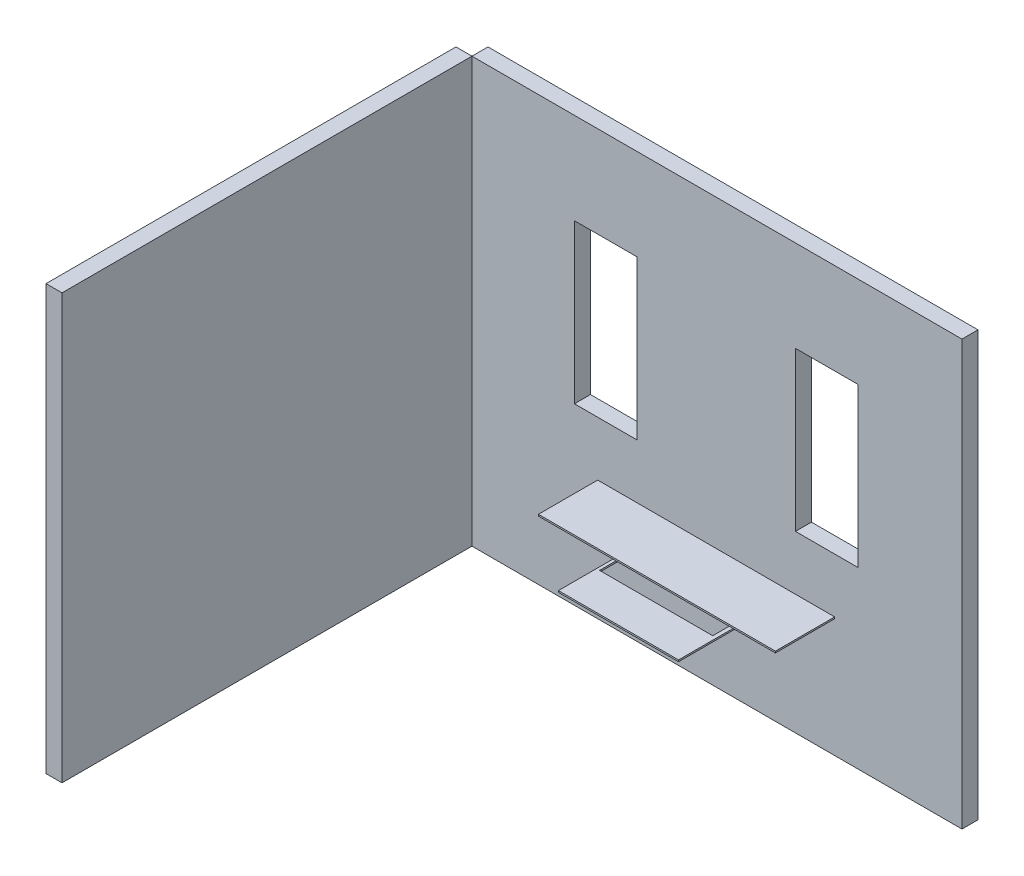
ISO-10303-21;
HEADER;
FILE_DESCRIPTION(('STEP AP214'),'2;1');
FILE_NAME('part.step','',(''),(''),'','','');
FILE_SCHEMA(('AUTOMOTIVE_DESIGN { 1 0 10303 214 1 1 1 1 }'));
ENDSEC;
DATA;
#1=APPLICATION_CONTEXT('core data for automotive mechanical design processes');
#2=APPLICATION_PROTOCOL_DEFINITION('international standard','automotive_design',2000,#1);
#3=PRODUCT_CONTEXT('',#1,'mechanical');
#4=PRODUCT('Part','Part','',(#3));
#5=PRODUCT_RELATED_PRODUCT_CATEGORY('part','',(#4));
#6=PRODUCT_DEFINITION_FORMATION('','',#4);
#7=PRODUCT_DEFINITION_CONTEXT('part definition',#1,'design');
#8=PRODUCT_DEFINITION('design','',#6,#7);
#9=PRODUCT_DEFINITION_SHAPE('','',#8);
#10=(LENGTH_UNIT() NAMED_UNIT(*) SI_UNIT(.MILLI.,.METRE.));
#11=(NAMED_UNIT(*) PLANE_ANGLE_UNIT() SI_UNIT($,.RADIAN.));
#12=(NAMED_UNIT(*) SI_UNIT($,.STERADIAN.) SOLID_ANGLE_UNIT());
#13=UNCERTAINTY_MEASURE_WITH_UNIT(LENGTH_MEASURE(1.E-05),#10,'distance_accuracy_value','');
#14=(GEOMETRIC_REPRESENTATION_CONTEXT(3) GLOBAL_UNCERTAINTY_ASSIGNED_CONTEXT((#13)) GLOBAL_UNIT_ASSIGNED_CONTEXT((#10,
#11,#12)) REPRESENTATION_CONTEXT('',''));
#15=CARTESIAN_POINT('',(0.,0.,0.));
#16=DIRECTION('',(0.,0.,1.));
#17=DIRECTION('',(1.,0.,0.));
#18=AXIS2_PLACEMENT_3D('',#15,#16,#17);
#19=CARTESIAN_POINT('',(0.,2650.,2660.));
#20=DIRECTION('',(-1.,0.,0.));
#21=DIRECTION('',(0.,0.,1.));
#22=AXIS2_PLACEMENT_3D('',#19,#20,#21);
#23=PLANE('',#22);
#24=DIRECTION('',(0.,1.,0.));
#25=VECTOR('',#24,1.);
#26=CARTESIAN_POINT('',(0.,2650.,100.));
#27=LINE('',#26,#25);
#28=CARTESIAN_POINT('',(0.,0.,100.));
#29=VERTEX_POINT('',#28);
#30=CARTESIAN_POINT('',(0.,2650.,100.));
#31=VERTEX_POINT('',#30);
#32=EDGE_CURVE('E106',#29,#31,#27,.T.);
#33=ORIENTED_EDGE('',*,*,#32,.T.);
#34=DIRECTION('',(0.,0.,-1.));
#35=VECTOR('',#34,1.);
#36=CARTESIAN_POINT('',(0.,2650.,2660.));
#37=LINE('',#36,#35);
#38=CARTESIAN_POINT('',(0.,2650.,2660.));
#39=VERTEX_POINT('',#38);
#40=EDGE_CURVE('E12',#39,#31,#37,.T.);
#41=ORIENTED_EDGE('',*,*,#40,.F.);
#42=DIRECTION('',(0.,1.,0.));
#43=VECTOR('',#42,1.);
#44=CARTESIAN_POINT('',(0.,2650.,2660.));
#45=LINE('',#44,#43);
#46=CARTESIAN_POINT('',(0.,0.,2660.));
#47=VERTEX_POINT('',#46);
#48=EDGE_CURVE('E94',#47,#39,#45,.T.);
#49=ORIENTED_EDGE('',*,*,#48,.F.);
#50=DIRECTION('',(0.,0.,-1.));
#51=VECTOR('',#50,1.);
#52=CARTESIAN_POINT('',(0.,0.,2660.));
#53=LINE('',#52,#51);
#54=EDGE_CURVE('E102',#47,#29,#53,.T.);
#55=ORIENTED_EDGE('',*,*,#54,.T.);
#56=EDGE_LOOP('',(#33,#41,#49,#55));
#57=FACE_BOUND('',#56,.T.);
#58=ADVANCED_FACE('F43',(#57),#23,.F.);
#59=CARTESIAN_POINT('',(0.,2650.,2660.));
#60=DIRECTION('',(0.,-1.,0.));
#61=DIRECTION('',(0.,0.,-1.));
#62=AXIS2_PLACEMENT_3D('',#59,#60,#61);
#63=PLANE('',#62);
#64=DIRECTION('',(-1.,0.,0.));
#65=VECTOR('',#64,1.);
#66=CARTESIAN_POINT('',(0.,2650.,100.));
#67=LINE('',#66,#65);
#68=CARTESIAN_POINT('',(-100.,2650.,100.));
#69=VERTEX_POINT('',#68);
#70=EDGE_CURVE('E98',#31,#69,#67,.T.);
#71=ORIENTED_EDGE('',*,*,#70,.T.);
#72=DIRECTION('',(0.,0.,-1.));
#73=VECTOR('',#72,1.);
#74=CARTESIAN_POINT('',(-100.,2650.,2660.));
#75=LINE('',#74,#73);
#76=CARTESIAN_POINT('',(-100.,2650.,2660.));
#77=VERTEX_POINT('',#76);
#78=EDGE_CURVE('E51',#77,#69,#75,.T.);
#79=ORIENTED_EDGE('',*,*,#78,.F.);
#80=DIRECTION('',(-1.,0.,0.));
#81=VECTOR('',#80,1.);
#82=CARTESIAN_POINT('',(0.,2650.,2660.));
#83=LINE('',#82,#81);
#84=EDGE_CURVE('E89',#39,#77,#83,.T.);
#85=ORIENTED_EDGE('',*,*,#84,.F.);
#86=ORIENTED_EDGE('',*,*,#40,.T.);
#87=EDGE_LOOP('',(#71,#79,#85,#86));
#88=FACE_BOUND('',#87,.T.);
#89=ADVANCED_FACE('F97',(#88),#63,.F.);
#90=CARTESIAN_POINT('',(-100.,2650.,2660.));
#91=DIRECTION('',(1.,0.,0.));
#92=DIRECTION('',(0.,1.,0.));
#93=AXIS2_PLACEMENT_3D('',#90,#91,#92);
#94=PLANE('',#93);
#95=DIRECTION('',(0.,-1.,0.));
#96=VECTOR('',#95,1.);
#97=CARTESIAN_POINT('',(-100.,2650.,100.));
#98=LINE('',#97,#96);
#99=CARTESIAN_POINT('',(-99.9999999999997,0.,100.));
#100=VERTEX_POINT('',#99);
#101=EDGE_CURVE('E76',#69,#100,#98,.T.);
#102=ORIENTED_EDGE('',*,*,#101,.T.);
#103=DIRECTION('',(0.,0.,-1.));
#104=VECTOR('',#103,1.);
#105=CARTESIAN_POINT('',(-99.9999999999997,0.,2660.));
#106=LINE('',#105,#104);
#107=CARTESIAN_POINT('',(-99.9999999999997,0.,2660.));
#108=VERTEX_POINT('',#107);
#109=EDGE_CURVE('E99',#108,#100,#106,.T.);
#110=ORIENTED_EDGE('',*,*,#109,.F.);
#111=DIRECTION('',(0.,-1.,0.));
#112=VECTOR('',#111,1.);
#113=CARTESIAN_POINT('',(-100.,2650.,2660.));
#114=LINE('',#113,#112);
#115=EDGE_CURVE('E92',#77,#108,#114,.T.);
#116=ORIENTED_EDGE('',*,*,#115,.F.);
#117=ORIENTED_EDGE('',*,*,#78,.T.);
#118=EDGE_LOOP('',(#102,#110,#116,#117));
#119=FACE_BOUND('',#118,.T.);
#120=ADVANCED_FACE('F100',(#119),#94,.F.);
#121=CARTESIAN_POINT('',(0.,0.,2660.));
#122=DIRECTION('',(0.,1.,0.));
#123=DIRECTION('',(-1.,0.,0.));
#124=AXIS2_PLACEMENT_3D('',#121,#122,#123);
#125=PLANE('',#124);
#126=DIRECTION('',(1.,0.,0.));
#127=VECTOR('',#126,1.);
#128=CARTESIAN_POINT('',(0.,0.,100.));
#129=LINE('',#128,#127);
#130=EDGE_CURVE('E82',#100,#29,#129,.T.);
#131=ORIENTED_EDGE('',*,*,#130,.T.);
#132=ORIENTED_EDGE('',*,*,#54,.F.);
#133=DIRECTION('',(1.,0.,0.));
#134=VECTOR('',#133,1.);
#135=CARTESIAN_POINT('',(0.,0.,2660.));
#136=LINE('',#135,#134);
#137=EDGE_CURVE('E59',#108,#47,#136,.T.);
#138=ORIENTED_EDGE('',*,*,#137,.F.);
#139=ORIENTED_EDGE('',*,*,#109,.T.);
#140=EDGE_LOOP('',(#131,#132,#138,#139));
#141=FACE_BOUND('',#140,.T.);
#142=ADVANCED_FACE('F113',(#141),#125,.F.);
#143=CARTESIAN_POINT('',(0.,0.,2660.));
#144=DIRECTION('',(0.,0.,-1.));
#145=DIRECTION('',(-1.,0.,0.));
#146=AXIS2_PLACEMENT_3D('',#143,#144,#145);
#147=PLANE('',#146);
#148=ORIENTED_EDGE('',*,*,#48,.T.);
#149=ORIENTED_EDGE('',*,*,#84,.T.);
#150=ORIENTED_EDGE('',*,*,#115,.T.);
#151=ORIENTED_EDGE('',*,*,#137,.T.);
#152=EDGE_LOOP('',(#148,#149,#150,#151));
#153=FACE_BOUND('',#152,.T.);
#154=ADVANCED_FACE('F90',(#153),#147,.F.);
#155=CARTESIAN_POINT('',(0.,0.,100.));
#156=DIRECTION('',(0.,0.,-1.));
#157=DIRECTION('',(-1.,0.,0.));
#158=AXIS2_PLACEMENT_3D('',#155,#156,#157);
#159=PLANE('',#158);
#160=ORIENTED_EDGE('',*,*,#32,.F.);
#161=ORIENTED_EDGE('',*,*,#130,.F.);
#162=ORIENTED_EDGE('',*,*,#101,.F.);
#163=ORIENTED_EDGE('',*,*,#70,.F.);
#164=EDGE_LOOP('',(#160,#161,#162,#163));
#165=FACE_BOUND('',#164,.T.);
#166=ADVANCED_FACE('F116',(#165),#159,.T.);
#167=CLOSED_SHELL('',(#58,#89,#120,#142,#154,#166));
#168=MANIFOLD_SOLID_BREP('B2',#167);
#169=CARTESIAN_POINT('',(0.,0.,100.));
#170=DIRECTION('',(0.,0.,-1.));
#171=DIRECTION('',(-1.,0.,0.));
#172=AXIS2_PLACEMENT_3D('',#169,#170,#171);
#173=PLANE('',#172);
#174=DIRECTION('',(0.,-1.,0.));
#175=VECTOR('',#174,1.);
#176=CARTESIAN_POINT('',(1876.15370242395,700.,100.));
#177=LINE('',#176,#175);
#178=CARTESIAN_POINT('',(1876.15370242395,640.,100.));
#179=VERTEX_POINT('',#178);
#180=CARTESIAN_POINT('',(1876.15370242395,630.,100.));
#181=VERTEX_POINT('',#180);
#182=EDGE_CURVE('E349',#179,#181,#177,.T.);
#183=ORIENTED_EDGE('',*,*,#182,.F.);
#184=DIRECTION('',(-1.,0.,0.));
#185=VECTOR('',#184,1.);
#186=CARTESIAN_POINT('',(0.,640.,100.));
#187=LINE('',#186,#185);
#188=CARTESIAN_POINT('',(1900.,640.,100.));
#189=VERTEX_POINT('',#188);
#190=EDGE_CURVE('E376',#189,#179,#187,.T.);
#191=ORIENTED_EDGE('',*,*,#190,.F.);
#192=DIRECTION('',(0.,1.,0.));
#193=VECTOR('',#192,1.);
#194=CARTESIAN_POINT('',(1900.,0.,100.));
#195=LINE('',#194,#193);
#196=CARTESIAN_POINT('',(1900.,630.,100.));
#197=VERTEX_POINT('',#196);
#198=EDGE_CURVE('E379',#197,#189,#195,.T.);
#199=ORIENTED_EDGE('',*,*,#198,.F.);
#200=DIRECTION('',(1.,0.,0.));
#201=VECTOR('',#200,1.);
#202=CARTESIAN_POINT('',(0.,630.,100.));
#203=LINE('',#202,#201);
#204=EDGE_CURVE('E382',#181,#197,#203,.T.);
#205=ORIENTED_EDGE('',*,*,#204,.F.);
#206=EDGE_LOOP('',(#183,#191,#199,#205));
#207=FACE_BOUND('',#206,.T.);
#208=DIRECTION('',(0.,-1.,0.));
#209=VECTOR('',#208,1.);
#210=CARTESIAN_POINT('',(785.000000000001,750.,100.));
#211=LINE('',#210,#209);
#212=CARTESIAN_POINT('',(785.000000000001,750.,100.));
#213=VERTEX_POINT('',#212);
#214=CARTESIAN_POINT('',(785.000000000001,740.,100.));
#215=VERTEX_POINT('',#214);
#216=EDGE_CURVE('E384',#213,#215,#211,.T.);
#217=ORIENTED_EDGE('',*,*,#216,.F.);
#218=DIRECTION('',(-1.,0.,0.));
#219=VECTOR('',#218,1.);
#220=CARTESIAN_POINT('',(2265.,750.,100.));
#221=LINE('',#220,#219);
#222=CARTESIAN_POINT('',(2265.,750.,100.));
#223=VERTEX_POINT('',#222);
#224=EDGE_CURVE('E389',#223,#213,#221,.T.);
#225=ORIENTED_EDGE('',*,*,#224,.F.);
#226=DIRECTION('',(0.,1.,0.));
#227=VECTOR('',#226,1.);
#228=CARTESIAN_POINT('',(2265.,740.,100.));
#229=LINE('',#228,#227);
#230=CARTESIAN_POINT('',(2265.,740.,100.));
#231=VERTEX_POINT('',#230);
#232=EDGE_CURVE('E401',#231,#223,#229,.T.);
#233=ORIENTED_EDGE('',*,*,#232,.F.);
#234=DIRECTION('',(1.,0.,0.));
#235=VECTOR('',#234,1.);
#236=CARTESIAN_POINT('',(785.000000000001,740.,100.));
#237=LINE('',#236,#235);
#238=EDGE_CURVE('E398',#215,#231,#237,.T.);
#239=ORIENTED_EDGE('',*,*,#238,.F.);
#240=EDGE_LOOP('',(#217,#225,#233,#239));
#241=FACE_BOUND('',#240,.T.);
#242=DIRECTION('',(0.,-1.,0.));
#243=VECTOR('',#242,1.);
#244=CARTESIAN_POINT('',(640.,2080.,100.));
#245=LINE('',#244,#243);
#246=CARTESIAN_POINT('',(640.,2080.,100.));
#247=VERTEX_POINT('',#246);
#248=CARTESIAN_POINT('',(640.,1090.,100.));
#249=VERTEX_POINT('',#248);
#250=EDGE_CURVE('E419',#247,#249,#245,.T.);
#251=ORIENTED_EDGE('',*,*,#250,.F.);
#252=DIRECTION('',(-1.,0.,0.));
#253=VECTOR('',#252,1.);
#254=CARTESIAN_POINT('',(640.,2080.,100.));
#255=LINE('',#254,#253);
#256=CARTESIAN_POINT('',(1030.,2080.,100.));
#257=VERTEX_POINT('',#256);
#258=EDGE_CURVE('E417',#257,#247,#255,.T.);
#259=ORIENTED_EDGE('',*,*,#258,.F.);
#260=DIRECTION('',(0.,1.,0.));
#261=VECTOR('',#260,1.);
#262=CARTESIAN_POINT('',(1030.,2080.,100.));
#263=LINE('',#262,#261);
#264=CARTESIAN_POINT('',(1030.,1090.,100.));
#265=VERTEX_POINT('',#264);
#266=EDGE_CURVE('E425',#265,#257,#263,.T.);
#267=ORIENTED_EDGE('',*,*,#266,.F.);
#268=DIRECTION('',(1.,0.,0.));
#269=VECTOR('',#268,1.);
#270=CARTESIAN_POINT('',(1030.,1090.,100.));
#271=LINE('',#270,#269);
#272=EDGE_CURVE('E422',#249,#265,#271,.T.);
#273=ORIENTED_EDGE('',*,*,#272,.F.);
#274=EDGE_LOOP('',(#251,#259,#267,#273));
#275=FACE_BOUND('',#274,.T.);
#276=DIRECTION('',(0.,1.,0.));
#277=VECTOR('',#276,1.);
#278=CARTESIAN_POINT('',(2410.,1090.,100.));
#279=LINE('',#278,#277);
#280=CARTESIAN_POINT('',(2410.,1090.,100.));
#281=VERTEX_POINT('',#280);
#282=CARTESIAN_POINT('',(2410.,2080.,100.));
#283=VERTEX_POINT('',#282);
#284=EDGE_CURVE('E439',#281,#283,#279,.T.);
#285=ORIENTED_EDGE('',*,*,#284,.F.);
#286=DIRECTION('',(1.,0.,0.));
#287=VECTOR('',#286,1.);
#288=CARTESIAN_POINT('',(2020.,1090.,100.));
#289=LINE('',#288,#287);
#290=CARTESIAN_POINT('',(2020.,1090.,100.));
#291=VERTEX_POINT('',#290);
#292=EDGE_CURVE('E431',#291,#281,#289,.T.);
#293=ORIENTED_EDGE('',*,*,#292,.F.);
#294=DIRECTION('',(0.,-1.,0.));
#295=VECTOR('',#294,1.);
#296=CARTESIAN_POINT('',(2020.,2080.,100.));
#297=LINE('',#296,#295);
#298=CARTESIAN_POINT('',(2020.,2080.,100.));
#299=VERTEX_POINT('',#298);
#300=EDGE_CURVE('E445',#299,#291,#297,.T.);
#301=ORIENTED_EDGE('',*,*,#300,.F.);
#302=DIRECTION('',(-1.,0.,0.));
#303=VECTOR('',#302,1.);
#304=CARTESIAN_POINT('',(2410.,2080.,100.));
#305=LINE('',#304,#303);
#306=EDGE_CURVE('E442',#283,#299,#305,.T.);
#307=ORIENTED_EDGE('',*,*,#306,.F.);
#308=EDGE_LOOP('',(#285,#293,#301,#307));
#309=FACE_BOUND('',#308,.T.);
#310=DIRECTION('',(0.,-1.,0.));
#311=VECTOR('',#310,1.);
#312=CARTESIAN_POINT('',(0.,0.,100.));
#313=LINE('',#312,#311);
#314=CARTESIAN_POINT('',(0.,2650.,100.));
#315=VERTEX_POINT('',#314);
#316=CARTESIAN_POINT('',(0.,0.,100.));
#317=VERTEX_POINT('',#316);
#318=EDGE_CURVE('E458',#315,#317,#313,.T.);
#319=ORIENTED_EDGE('',*,*,#318,.T.);
#320=DIRECTION('',(1.,0.,0.));
#321=VECTOR('',#320,1.);
#322=CARTESIAN_POINT('',(0.,0.,100.));
#323=LINE('',#322,#321);
#324=CARTESIAN_POINT('',(3060.,0.,100.));
#325=VERTEX_POINT('',#324);
#326=EDGE_CURVE('E461',#317,#325,#323,.T.);
#327=ORIENTED_EDGE('',*,*,#326,.T.);
#328=DIRECTION('',(0.,1.,0.));
#329=VECTOR('',#328,1.);
#330=CARTESIAN_POINT('',(3060.,0.,100.));
#331=LINE('',#330,#329);
#332=CARTESIAN_POINT('',(3060.,2650.,100.));
#333=VERTEX_POINT('',#332);
#334=EDGE_CURVE('E464',#325,#333,#331,.T.);
#335=ORIENTED_EDGE('',*,*,#334,.T.);
#336=DIRECTION('',(-1.,0.,0.));
#337=VECTOR('',#336,1.);
#338=CARTESIAN_POINT('',(0.,2650.,100.));
#339=LINE('',#338,#337);
#340=EDGE_CURVE('E466',#333,#315,#339,.T.);
#341=ORIENTED_EDGE('',*,*,#340,.T.);
#342=EDGE_LOOP('',(#319,#327,#335,#341));
#343=FACE_BOUND('',#342,.T.);
#344=CARTESIAN_POINT('',(1169.06798255074,640.,100.));
#345=VERTEX_POINT('',#344);
#346=CARTESIAN_POINT('',(1150.,640.,100.));
#347=VERTEX_POINT('',#346);
#348=EDGE_CURVE('E375',#345,#347,#187,.T.);
#349=ORIENTED_EDGE('',*,*,#348,.F.);
#350=DIRECTION('',(0.,-1.,0.));
#351=VECTOR('',#350,1.);
#352=CARTESIAN_POINT('',(1169.06798255074,700.,100.));
#353=LINE('',#352,#351);
#354=CARTESIAN_POINT('',(1169.06798255074,630.,100.));
#355=VERTEX_POINT('',#354);
#356=EDGE_CURVE('E334',#345,#355,#353,.T.);
#357=ORIENTED_EDGE('',*,*,#356,.T.);
#358=CARTESIAN_POINT('',(1150.,630.,100.));
#359=VERTEX_POINT('',#358);
#360=EDGE_CURVE('E344',#359,#355,#203,.T.);
#361=ORIENTED_EDGE('',*,*,#360,.F.);
#362=DIRECTION('',(0.,-1.,0.));
#363=VECTOR('',#362,1.);
#364=CARTESIAN_POINT('',(1150.,0.,100.));
#365=LINE('',#364,#363);
#366=EDGE_CURVE('E372',#347,#359,#365,.T.);
#367=ORIENTED_EDGE('',*,*,#366,.F.);
#368=EDGE_LOOP('',(#349,#357,#361,#367));
#369=FACE_BOUND('',#368,.T.);
#370=ADVANCED_FACE('F167',(#207,#241,#275,#309,#343,#369),#173,.F.);
#371=CARTESIAN_POINT('',(0.,0.,100.));
#372=DIRECTION('',(1.,0.,0.));
#373=DIRECTION('',(0.,0.,-1.));
#374=AXIS2_PLACEMENT_3D('',#371,#372,#373);
#375=PLANE('',#374);
#376=DIRECTION('',(0.,-1.,0.));
#377=VECTOR('',#376,1.);
#378=CARTESIAN_POINT('',(0.,0.,0.));
#379=LINE('',#378,#377);
#380=CARTESIAN_POINT('',(0.,2650.,0.));
#381=VERTEX_POINT('',#380);
#382=CARTESIAN_POINT('',(0.,0.,0.));
#383=VERTEX_POINT('',#382);
#384=EDGE_CURVE('E451',#381,#383,#379,.T.);
#385=ORIENTED_EDGE('',*,*,#384,.T.);
#386=DIRECTION('',(0.,0.,-1.));
#387=VECTOR('',#386,1.);
#388=CARTESIAN_POINT('',(0.,0.,100.));
#389=LINE('',#388,#387);
#390=EDGE_CURVE('E484',#317,#383,#389,.T.);
#391=ORIENTED_EDGE('',*,*,#390,.F.);
#392=ORIENTED_EDGE('',*,*,#318,.F.);
#393=DIRECTION('',(0.,0.,-1.));
#394=VECTOR('',#393,1.);
#395=CARTESIAN_POINT('',(0.,2650.,100.));
#396=LINE('',#395,#394);
#397=EDGE_CURVE('E468',#315,#381,#396,.T.);
#398=ORIENTED_EDGE('',*,*,#397,.T.);
#399=EDGE_LOOP('',(#385,#391,#392,#398));
#400=FACE_BOUND('',#399,.T.);
#401=ADVANCED_FACE('F169',(#400),#375,.F.);
#402=CARTESIAN_POINT('',(0.,0.,100.));
#403=DIRECTION('',(0.,1.,0.));
#404=DIRECTION('',(0.,0.,1.));
#405=AXIS2_PLACEMENT_3D('',#402,#403,#404);
#406=PLANE('',#405);
#407=DIRECTION('',(1.,0.,0.));
#408=VECTOR('',#407,1.);
#409=CARTESIAN_POINT('',(0.,0.,0.));
#410=LINE('',#409,#408);
#411=CARTESIAN_POINT('',(3060.,0.,0.));
#412=VERTEX_POINT('',#411);
#413=EDGE_CURVE('E471',#383,#412,#410,.T.);
#414=ORIENTED_EDGE('',*,*,#413,.T.);
#415=DIRECTION('',(0.,0.,-1.));
#416=VECTOR('',#415,1.);
#417=CARTESIAN_POINT('',(3060.,0.,100.));
#418=LINE('',#417,#416);
#419=EDGE_CURVE('E481',#325,#412,#418,.T.);
#420=ORIENTED_EDGE('',*,*,#419,.F.);
#421=ORIENTED_EDGE('',*,*,#326,.F.);
#422=ORIENTED_EDGE('',*,*,#390,.T.);
#423=EDGE_LOOP('',(#414,#420,#421,#422));
#424=FACE_BOUND('',#423,.T.);
#425=ADVANCED_FACE('F544',(#424),#406,.F.);
#426=CARTESIAN_POINT('',(3060.,0.,100.));
#427=DIRECTION('',(-1.,0.,0.));
#428=DIRECTION('',(0.,0.,1.));
#429=AXIS2_PLACEMENT_3D('',#426,#427,#428);
#430=PLANE('',#429);
#431=DIRECTION('',(0.,1.,0.));
#432=VECTOR('',#431,1.);
#433=CARTESIAN_POINT('',(3060.,0.,0.));
#434=LINE('',#433,#432);
#435=CARTESIAN_POINT('',(3060.,2650.,0.));
#436=VERTEX_POINT('',#435);
#437=EDGE_CURVE('E473',#412,#436,#434,.T.);
#438=ORIENTED_EDGE('',*,*,#437,.T.);
#439=DIRECTION('',(0.,0.,-1.));
#440=VECTOR('',#439,1.);
#441=CARTESIAN_POINT('',(3060.,2650.,100.));
#442=LINE('',#441,#440);
#443=EDGE_CURVE('E478',#333,#436,#442,.T.);
#444=ORIENTED_EDGE('',*,*,#443,.F.);
#445=ORIENTED_EDGE('',*,*,#334,.F.);
#446=ORIENTED_EDGE('',*,*,#419,.T.);
#447=EDGE_LOOP('',(#438,#444,#445,#446));
#448=FACE_BOUND('',#447,.T.);
#449=ADVANCED_FACE('F557',(#448),#430,.F.);
#450=CARTESIAN_POINT('',(0.,2650.,100.));
#451=DIRECTION('',(0.,-1.,0.));
#452=DIRECTION('',(0.,0.,-1.));
#453=AXIS2_PLACEMENT_3D('',#450,#451,#452);
#454=PLANE('',#453);
#455=DIRECTION('',(-1.,0.,0.));
#456=VECTOR('',#455,1.);
#457=CARTESIAN_POINT('',(0.,2650.,0.));
#458=LINE('',#457,#456);
#459=EDGE_CURVE('E462',#436,#381,#458,.T.);
#460=ORIENTED_EDGE('',*,*,#459,.T.);
#461=ORIENTED_EDGE('',*,*,#397,.F.);
#462=ORIENTED_EDGE('',*,*,#340,.F.);
#463=ORIENTED_EDGE('',*,*,#443,.T.);
#464=EDGE_LOOP('',(#460,#461,#462,#463));
#465=FACE_BOUND('',#464,.T.);
#466=ADVANCED_FACE('F553',(#465),#454,.F.);
#467=CARTESIAN_POINT('',(0.,0.,0.));
#468=DIRECTION('',(0.,0.,-1.));
#469=DIRECTION('',(-1.,0.,0.));
#470=AXIS2_PLACEMENT_3D('',#467,#468,#469);
#471=PLANE('',#470);
#472=ORIENTED_EDGE('',*,*,#384,.F.);
#473=ORIENTED_EDGE('',*,*,#459,.F.);
#474=ORIENTED_EDGE('',*,*,#437,.F.);
#475=ORIENTED_EDGE('',*,*,#413,.F.);
#476=EDGE_LOOP('',(#472,#473,#474,#475));
#477=FACE_BOUND('',#476,.T.);
#478=DIRECTION('',(-1.,0.,0.));
#479=VECTOR('',#478,1.);
#480=CARTESIAN_POINT('',(0.,1090.,0.));
#481=LINE('',#480,#479);
#482=CARTESIAN_POINT('',(2410.,1090.,0.));
#483=VERTEX_POINT('',#482);
#484=CARTESIAN_POINT('',(2020.,1090.,0.));
#485=VERTEX_POINT('',#484);
#486=EDGE_CURVE('E494',#483,#485,#481,.T.);
#487=ORIENTED_EDGE('',*,*,#486,.F.);
#488=DIRECTION('',(0.,-1.,0.));
#489=VECTOR('',#488,1.);
#490=CARTESIAN_POINT('',(2410.,0.,0.));
#491=LINE('',#490,#489);
#492=CARTESIAN_POINT('',(2410.,2080.,0.));
#493=VERTEX_POINT('',#492);
#494=EDGE_CURVE('E487',#493,#483,#491,.T.);
#495=ORIENTED_EDGE('',*,*,#494,.F.);
#496=DIRECTION('',(1.,0.,0.));
#497=VECTOR('',#496,1.);
#498=CARTESIAN_POINT('',(0.,2080.,0.));
#499=LINE('',#498,#497);
#500=CARTESIAN_POINT('',(2020.,2080.,0.));
#501=VERTEX_POINT('',#500);
#502=EDGE_CURVE('E489',#501,#493,#499,.T.);
#503=ORIENTED_EDGE('',*,*,#502,.F.);
#504=DIRECTION('',(0.,1.,0.));
#505=VECTOR('',#504,1.);
#506=CARTESIAN_POINT('',(2020.,0.,0.));
#507=LINE('',#506,#505);
#508=EDGE_CURVE('E492',#485,#501,#507,.T.);
#509=ORIENTED_EDGE('',*,*,#508,.F.);
#510=EDGE_LOOP('',(#487,#495,#503,#509));
#511=FACE_BOUND('',#510,.T.);
#512=DIRECTION('',(1.,0.,0.));
#513=VECTOR('',#512,1.);
#514=CARTESIAN_POINT('',(0.,2080.,0.));
#515=LINE('',#514,#513);
#516=CARTESIAN_POINT('',(640.,2080.,0.));
#517=VERTEX_POINT('',#516);
#518=CARTESIAN_POINT('',(1030.,2080.,0.));
#519=VERTEX_POINT('',#518);
#520=EDGE_CURVE('E503',#517,#519,#515,.T.);
#521=ORIENTED_EDGE('',*,*,#520,.F.);
#522=DIRECTION('',(0.,1.,0.));
#523=VECTOR('',#522,1.);
#524=CARTESIAN_POINT('',(640.,0.,0.));
#525=LINE('',#524,#523);
#526=CARTESIAN_POINT('',(640.,1090.,0.));
#527=VERTEX_POINT('',#526);
#528=EDGE_CURVE('E496',#527,#517,#525,.T.);
#529=ORIENTED_EDGE('',*,*,#528,.F.);
#530=DIRECTION('',(-1.,0.,0.));
#531=VECTOR('',#530,1.);
#532=CARTESIAN_POINT('',(0.,1090.,0.));
#533=LINE('',#532,#531);
#534=CARTESIAN_POINT('',(1030.,1090.,0.));
#535=VERTEX_POINT('',#534);
#536=EDGE_CURVE('E498',#535,#527,#533,.T.);
#537=ORIENTED_EDGE('',*,*,#536,.F.);
#538=DIRECTION('',(0.,-1.,0.));
#539=VECTOR('',#538,1.);
#540=CARTESIAN_POINT('',(1030.,0.,0.));
#541=LINE('',#540,#539);
#542=EDGE_CURVE('E501',#519,#535,#541,.T.);
#543=ORIENTED_EDGE('',*,*,#542,.F.);
#544=EDGE_LOOP('',(#521,#529,#537,#543));
#545=FACE_BOUND('',#544,.T.);
#546=ADVANCED_FACE('F550',(#477,#511,#545),#471,.T.);
#547=CARTESIAN_POINT('',(2020.,1090.,-649.));
#548=DIRECTION('',(0.,-1.,0.));
#549=DIRECTION('',(0.,0.,-1.));
#550=AXIS2_PLACEMENT_3D('',#547,#548,#549);
#551=PLANE('',#550);
#552=ORIENTED_EDGE('',*,*,#486,.T.);
#553=DIRECTION('',(0.,0.,1.));
#554=VECTOR('',#553,1.);
#555=CARTESIAN_POINT('',(2020.,1090.,-649.));
#556=LINE('',#555,#554);
#557=EDGE_CURVE('E449',#485,#291,#556,.T.);
#558=ORIENTED_EDGE('',*,*,#557,.T.);
#559=ORIENTED_EDGE('',*,*,#292,.T.);
#560=DIRECTION('',(0.,0.,1.));
#561=VECTOR('',#560,1.);
#562=CARTESIAN_POINT('',(2410.,1090.,-649.));
#563=LINE('',#562,#561);
#564=EDGE_CURVE('E448',#483,#281,#563,.T.);
#565=ORIENTED_EDGE('',*,*,#564,.F.);
#566=EDGE_LOOP('',(#552,#558,#559,#565));
#567=FACE_BOUND('',#566,.T.);
#568=ADVANCED_FACE('F548',(#567),#551,.F.);
#569=CARTESIAN_POINT('',(2020.,2080.,-649.));
#570=DIRECTION('',(-1.,0.,0.));
#571=DIRECTION('',(0.,0.,1.));
#572=AXIS2_PLACEMENT_3D('',#569,#570,#571);
#573=PLANE('',#572);
#574=ORIENTED_EDGE('',*,*,#508,.T.);
#575=DIRECTION('',(0.,0.,1.));
#576=VECTOR('',#575,1.);
#577=CARTESIAN_POINT('',(2020.,2080.,-649.));
#578=LINE('',#577,#576);
#579=EDGE_CURVE('E452',#501,#299,#578,.T.);
#580=ORIENTED_EDGE('',*,*,#579,.T.);
#581=ORIENTED_EDGE('',*,*,#300,.T.);
#582=ORIENTED_EDGE('',*,*,#557,.F.);
#583=EDGE_LOOP('',(#574,#580,#581,#582));
#584=FACE_BOUND('',#583,.T.);
#585=ADVANCED_FACE('F616',(#584),#573,.F.);
#586=CARTESIAN_POINT('',(2410.,2080.,-649.));
#587=DIRECTION('',(0.,1.,0.));
#588=DIRECTION('',(0.,0.,1.));
#589=AXIS2_PLACEMENT_3D('',#586,#587,#588);
#590=PLANE('',#589);
#591=ORIENTED_EDGE('',*,*,#502,.T.);
#592=DIRECTION('',(0.,0.,1.));
#593=VECTOR('',#592,1.);
#594=CARTESIAN_POINT('',(2410.,2080.,-649.));
#595=LINE('',#594,#593);
#596=EDGE_CURVE('E454',#493,#283,#595,.T.);
#597=ORIENTED_EDGE('',*,*,#596,.T.);
#598=ORIENTED_EDGE('',*,*,#306,.T.);
#599=ORIENTED_EDGE('',*,*,#579,.F.);
#600=EDGE_LOOP('',(#591,#597,#598,#599));
#601=FACE_BOUND('',#600,.T.);
#602=ADVANCED_FACE('F619',(#601),#590,.F.);
#603=CARTESIAN_POINT('',(2410.,1090.,-649.));
#604=DIRECTION('',(1.,0.,0.));
#605=DIRECTION('',(0.,0.,-1.));
#606=AXIS2_PLACEMENT_3D('',#603,#604,#605);
#607=PLANE('',#606);
#608=ORIENTED_EDGE('',*,*,#494,.T.);
#609=ORIENTED_EDGE('',*,*,#564,.T.);
#610=ORIENTED_EDGE('',*,*,#284,.T.);
#611=ORIENTED_EDGE('',*,*,#596,.F.);
#612=EDGE_LOOP('',(#608,#609,#610,#611));
#613=FACE_BOUND('',#612,.T.);
#614=ADVANCED_FACE('F615',(#613),#607,.F.);
#615=CARTESIAN_POINT('',(640.,2080.,-649.));
#616=DIRECTION('',(0.,1.,0.));
#617=DIRECTION('',(0.,0.,1.));
#618=AXIS2_PLACEMENT_3D('',#615,#616,#617);
#619=PLANE('',#618);
#620=ORIENTED_EDGE('',*,*,#520,.T.);
#621=DIRECTION('',(0.,0.,1.));
#622=VECTOR('',#621,1.);
#623=CARTESIAN_POINT('',(1030.,2080.,-649.));
#624=LINE('',#623,#622);
#625=EDGE_CURVE('E429',#519,#257,#624,.T.);
#626=ORIENTED_EDGE('',*,*,#625,.T.);
#627=ORIENTED_EDGE('',*,*,#258,.T.);
#628=DIRECTION('',(0.,0.,1.));
#629=VECTOR('',#628,1.);
#630=CARTESIAN_POINT('',(640.,2080.,-649.));
#631=LINE('',#630,#629);
#632=EDGE_CURVE('E428',#517,#247,#631,.T.);
#633=ORIENTED_EDGE('',*,*,#632,.F.);
#634=EDGE_LOOP('',(#620,#626,#627,#633));
#635=FACE_BOUND('',#634,.T.);
#636=ADVANCED_FACE('F588',(#635),#619,.F.);
#637=CARTESIAN_POINT('',(1030.,2080.,-649.));
#638=DIRECTION('',(1.,0.,0.));
#639=DIRECTION('',(0.,0.,-1.));
#640=AXIS2_PLACEMENT_3D('',#637,#638,#639);
#641=PLANE('',#640);
#642=ORIENTED_EDGE('',*,*,#542,.T.);
#643=DIRECTION('',(0.,0.,1.));
#644=VECTOR('',#643,1.);
#645=CARTESIAN_POINT('',(1030.,1090.,-649.));
#646=LINE('',#645,#644);
#647=EDGE_CURVE('E432',#535,#265,#646,.T.);
#648=ORIENTED_EDGE('',*,*,#647,.T.);
#649=ORIENTED_EDGE('',*,*,#266,.T.);
#650=ORIENTED_EDGE('',*,*,#625,.F.);
#651=EDGE_LOOP('',(#642,#648,#649,#650));
#652=FACE_BOUND('',#651,.T.);
#653=ADVANCED_FACE('F590',(#652),#641,.F.);
#654=CARTESIAN_POINT('',(1030.,1090.,-649.));
#655=DIRECTION('',(0.,-1.,0.));
#656=DIRECTION('',(0.,0.,-1.));
#657=AXIS2_PLACEMENT_3D('',#654,#655,#656);
#658=PLANE('',#657);
#659=ORIENTED_EDGE('',*,*,#536,.T.);
#660=DIRECTION('',(0.,0.,1.));
#661=VECTOR('',#660,1.);
#662=CARTESIAN_POINT('',(640.,1090.,-649.));
#663=LINE('',#662,#661);
#664=EDGE_CURVE('E434',#527,#249,#663,.T.);
#665=ORIENTED_EDGE('',*,*,#664,.T.);
#666=ORIENTED_EDGE('',*,*,#272,.T.);
#667=ORIENTED_EDGE('',*,*,#647,.F.);
#668=EDGE_LOOP('',(#659,#665,#666,#667));
#669=FACE_BOUND('',#668,.T.);
#670=ADVANCED_FACE('F601',(#669),#658,.F.);
#671=CARTESIAN_POINT('',(640.,2080.,-649.));
#672=DIRECTION('',(-1.,0.,0.));
#673=DIRECTION('',(0.,-1.,0.));
#674=AXIS2_PLACEMENT_3D('',#671,#672,#673);
#675=PLANE('',#674);
#676=ORIENTED_EDGE('',*,*,#528,.T.);
#677=ORIENTED_EDGE('',*,*,#632,.T.);
#678=ORIENTED_EDGE('',*,*,#250,.T.);
#679=ORIENTED_EDGE('',*,*,#664,.F.);
#680=EDGE_LOOP('',(#676,#677,#678,#679));
#681=FACE_BOUND('',#680,.T.);
#682=ADVANCED_FACE('F599',(#681),#675,.F.);
#683=CARTESIAN_POINT('',(785.000000000001,750.,470.));
#684=DIRECTION('',(1.,0.,0.));
#685=DIRECTION('',(0.,0.,-1.));
#686=AXIS2_PLACEMENT_3D('',#683,#684,#685);
#687=PLANE('',#686);
#688=ORIENTED_EDGE('',*,*,#216,.T.);
#689=DIRECTION('',(0.,0.,-1.));
#690=VECTOR('',#689,1.);
#691=CARTESIAN_POINT('',(785.000000000001,740.,470.));
#692=LINE('',#691,#690);
#693=CARTESIAN_POINT('',(785.000000000001,740.,470.));
#694=VERTEX_POINT('',#693);
#695=EDGE_CURVE('E414',#694,#215,#692,.T.);
#696=ORIENTED_EDGE('',*,*,#695,.F.);
#697=DIRECTION('',(0.,-1.,0.));
#698=VECTOR('',#697,1.);
#699=CARTESIAN_POINT('',(785.000000000001,750.,470.));
#700=LINE('',#699,#698);
#701=CARTESIAN_POINT('',(785.000000000001,750.,470.));
#702=VERTEX_POINT('',#701);
#703=EDGE_CURVE('E385',#702,#694,#700,.T.);
#704=ORIENTED_EDGE('',*,*,#703,.F.);
#705=DIRECTION('',(0.,0.,-1.));
#706=VECTOR('',#705,1.);
#707=CARTESIAN_POINT('',(785.000000000001,750.,470.));
#708=LINE('',#707,#706);
#709=EDGE_CURVE('E395',#702,#213,#708,.T.);
#710=ORIENTED_EDGE('',*,*,#709,.T.);
#711=EDGE_LOOP('',(#688,#696,#704,#710));
#712=FACE_BOUND('',#711,.T.);
#713=ADVANCED_FACE('F608',(#712),#687,.F.);
#714=CARTESIAN_POINT('',(785.000000000001,740.,470.));
#715=DIRECTION('',(0.,1.,0.));
#716=DIRECTION('',(0.,0.,1.));
#717=AXIS2_PLACEMENT_3D('',#714,#715,#716);
#718=PLANE('',#717);
#719=ORIENTED_EDGE('',*,*,#238,.T.);
#720=DIRECTION('',(0.,0.,-1.));
#721=VECTOR('',#720,1.);
#722=CARTESIAN_POINT('',(2265.,740.,470.));
#723=LINE('',#722,#721);
#724=CARTESIAN_POINT('',(2265.,740.,470.));
#725=VERTEX_POINT('',#724);
#726=EDGE_CURVE('E411',#725,#231,#723,.T.);
#727=ORIENTED_EDGE('',*,*,#726,.F.);
#728=DIRECTION('',(1.,0.,0.));
#729=VECTOR('',#728,1.);
#730=CARTESIAN_POINT('',(785.000000000001,740.,470.));
#731=LINE('',#730,#729);
#732=EDGE_CURVE('E388',#694,#725,#731,.T.);
#733=ORIENTED_EDGE('',*,*,#732,.F.);
#734=ORIENTED_EDGE('',*,*,#695,.T.);
#735=EDGE_LOOP('',(#719,#727,#733,#734));
#736=FACE_BOUND('',#735,.T.);
#737=ADVANCED_FACE('F685',(#736),#718,.F.);
#738=CARTESIAN_POINT('',(2265.,740.,470.));
#739=DIRECTION('',(-1.,0.,0.));
#740=DIRECTION('',(0.,0.,1.));
#741=AXIS2_PLACEMENT_3D('',#738,#739,#740);
#742=PLANE('',#741);
#743=ORIENTED_EDGE('',*,*,#232,.T.);
#744=DIRECTION('',(0.,0.,-1.));
#745=VECTOR('',#744,1.);
#746=CARTESIAN_POINT('',(2265.,750.,470.));
#747=LINE('',#746,#745);
#748=CARTESIAN_POINT('',(2265.,750.,470.));
#749=VERTEX_POINT('',#748);
#750=EDGE_CURVE('E408',#749,#223,#747,.T.);
#751=ORIENTED_EDGE('',*,*,#750,.F.);
#752=DIRECTION('',(0.,1.,0.));
#753=VECTOR('',#752,1.);
#754=CARTESIAN_POINT('',(2265.,740.,470.));
#755=LINE('',#754,#753);
#756=EDGE_CURVE('E391',#725,#749,#755,.T.);
#757=ORIENTED_EDGE('',*,*,#756,.F.);
#758=ORIENTED_EDGE('',*,*,#726,.T.);
#759=EDGE_LOOP('',(#743,#751,#757,#758));
#760=FACE_BOUND('',#759,.T.);
#761=ADVANCED_FACE('F694',(#760),#742,.F.);
#762=CARTESIAN_POINT('',(2265.,750.,470.));
#763=DIRECTION('',(0.,-1.,0.));
#764=DIRECTION('',(1.,0.,0.));
#765=AXIS2_PLACEMENT_3D('',#762,#763,#764);
#766=PLANE('',#765);
#767=ORIENTED_EDGE('',*,*,#224,.T.);
#768=ORIENTED_EDGE('',*,*,#709,.F.);
#769=DIRECTION('',(-1.,0.,0.));
#770=VECTOR('',#769,1.);
#771=CARTESIAN_POINT('',(2265.,750.,470.));
#772=LINE('',#771,#770);
#773=EDGE_CURVE('E393',#749,#702,#772,.T.);
#774=ORIENTED_EDGE('',*,*,#773,.F.);
#775=ORIENTED_EDGE('',*,*,#750,.T.);
#776=EDGE_LOOP('',(#767,#768,#774,#775));
#777=FACE_BOUND('',#776,.T.);
#778=ADVANCED_FACE('F704',(#777),#766,.F.);
#779=CARTESIAN_POINT('',(0.,0.,470.));
#780=DIRECTION('',(0.,0.,1.));
#781=DIRECTION('',(1.,0.,0.));
#782=AXIS2_PLACEMENT_3D('',#779,#780,#781);
#783=PLANE('',#782);
#784=ORIENTED_EDGE('',*,*,#703,.T.);
#785=ORIENTED_EDGE('',*,*,#732,.T.);
#786=ORIENTED_EDGE('',*,*,#756,.T.);
#787=ORIENTED_EDGE('',*,*,#773,.T.);
#788=EDGE_LOOP('',(#784,#785,#786,#787));
#789=FACE_BOUND('',#788,.T.);
#790=ADVANCED_FACE('F714',(#789),#783,.T.);
#791=CARTESIAN_POINT('',(1900.,630.,710.));
#792=DIRECTION('',(0.,1.,0.));
#793=DIRECTION('',(-1.,0.,0.));
#794=AXIS2_PLACEMENT_3D('',#791,#792,#793);
#795=PLANE('',#794);
#796=DIRECTION('',(-1.,0.,0.));
#797=VECTOR('',#796,1.);
#798=CARTESIAN_POINT('',(1169.06798255074,630.,472.624570159227));
#799=LINE('',#798,#797);
#800=CARTESIAN_POINT('',(1876.15370242395,630.,472.624570159227));
#801=VERTEX_POINT('',#800);
#802=CARTESIAN_POINT('',(1169.06798255074,630.,472.624570159227));
#803=VERTEX_POINT('',#802);
#804=EDGE_CURVE('E338',#801,#803,#799,.T.);
#805=ORIENTED_EDGE('',*,*,#804,.F.);
#806=DIRECTION('',(0.,0.,1.));
#807=VECTOR('',#806,1.);
#808=CARTESIAN_POINT('',(1876.15370242395,630.,100.));
#809=LINE('',#808,#807);
#810=EDGE_CURVE('E182',#181,#801,#809,.T.);
#811=ORIENTED_EDGE('',*,*,#810,.F.);
#812=ORIENTED_EDGE('',*,*,#204,.T.);
#813=DIRECTION('',(0.,0.,-1.));
#814=VECTOR('',#813,1.);
#815=CARTESIAN_POINT('',(1900.,630.,710.));
#816=LINE('',#815,#814);
#817=CARTESIAN_POINT('',(1900.,630.,710.));
#818=VERTEX_POINT('',#817);
#819=EDGE_CURVE('E369',#818,#197,#816,.T.);
#820=ORIENTED_EDGE('',*,*,#819,.F.);
#821=DIRECTION('',(1.,0.,0.));
#822=VECTOR('',#821,1.);
#823=CARTESIAN_POINT('',(1900.,630.,710.));
#824=LINE('',#823,#822);
#825=CARTESIAN_POINT('',(1150.,630.,710.));
#826=VERTEX_POINT('',#825);
#827=EDGE_CURVE('E351',#826,#818,#824,.T.);
#828=ORIENTED_EDGE('',*,*,#827,.F.);
#829=DIRECTION('',(0.,0.,-1.));
#830=VECTOR('',#829,1.);
#831=CARTESIAN_POINT('',(1150.,630.,710.));
#832=LINE('',#831,#830);
#833=EDGE_CURVE('E361',#826,#359,#832,.T.);
#834=ORIENTED_EDGE('',*,*,#833,.T.);
#835=ORIENTED_EDGE('',*,*,#360,.T.);
#836=DIRECTION('',(0.,0.,-1.));
#837=VECTOR('',#836,1.);
#838=CARTESIAN_POINT('',(1169.06798255074,630.,100.));
#839=LINE('',#838,#837);
#840=EDGE_CURVE('E330',#803,#355,#839,.T.);
#841=ORIENTED_EDGE('',*,*,#840,.F.);
#842=EDGE_LOOP('',(#805,#811,#812,#820,#828,#834,#835,#841));
#843=FACE_BOUND('',#842,.T.);
#844=ADVANCED_FACE('F342',(#843),#795,.F.);
#845=CARTESIAN_POINT('',(1900.,640.,710.));
#846=DIRECTION('',(-1.,0.,0.));
#847=DIRECTION('',(0.,0.,1.));
#848=AXIS2_PLACEMENT_3D('',#845,#846,#847);
#849=PLANE('',#848);
#850=ORIENTED_EDGE('',*,*,#819,.T.);
#851=ORIENTED_EDGE('',*,*,#198,.T.);
#852=DIRECTION('',(0.,0.,-1.));
#853=VECTOR('',#852,1.);
#854=CARTESIAN_POINT('',(1900.,640.,710.));
#855=LINE('',#854,#853);
#856=CARTESIAN_POINT('',(1900.,640.,710.));
#857=VERTEX_POINT('',#856);
#858=EDGE_CURVE('E366',#857,#189,#855,.T.);
#859=ORIENTED_EDGE('',*,*,#858,.F.);
#860=DIRECTION('',(0.,1.,0.));
#861=VECTOR('',#860,1.);
#862=CARTESIAN_POINT('',(1900.,640.,710.));
#863=LINE('',#862,#861);
#864=EDGE_CURVE('E355',#818,#857,#863,.T.);
#865=ORIENTED_EDGE('',*,*,#864,.F.);
#866=EDGE_LOOP('',(#850,#851,#859,#865));
#867=FACE_BOUND('',#866,.T.);
#868=ADVANCED_FACE('F523',(#867),#849,.F.);
#869=CARTESIAN_POINT('',(1150.,640.,710.));
#870=DIRECTION('',(0.,-1.,0.));
#871=DIRECTION('',(1.,0.,0.));
#872=AXIS2_PLACEMENT_3D('',#869,#870,#871);
#873=PLANE('',#872);
#874=ORIENTED_EDGE('',*,*,#190,.T.);
#875=DIRECTION('',(0.,0.,1.));
#876=VECTOR('',#875,1.);
#877=CARTESIAN_POINT('',(1876.15370242395,640.,710.));
#878=LINE('',#877,#876);
#879=CARTESIAN_POINT('',(1876.15370242395,640.,472.624570159227));
#880=VERTEX_POINT('',#879);
#881=EDGE_CURVE('E41',#179,#880,#878,.T.);
#882=ORIENTED_EDGE('',*,*,#881,.T.);
#883=DIRECTION('',(-1.,0.,0.));
#884=VECTOR('',#883,1.);
#885=CARTESIAN_POINT('',(1150.,640.,472.624570159227));
#886=LINE('',#885,#884);
#887=CARTESIAN_POINT('',(1169.06798255074,640.,472.624570159227));
#888=VERTEX_POINT('',#887);
#889=EDGE_CURVE('E505',#880,#888,#886,.T.);
#890=ORIENTED_EDGE('',*,*,#889,.T.);
#891=DIRECTION('',(0.,0.,-1.));
#892=VECTOR('',#891,1.);
#893=CARTESIAN_POINT('',(1169.06798255074,640.,710.));
#894=LINE('',#893,#892);
#895=EDGE_CURVE('E175',#888,#345,#894,.T.);
#896=ORIENTED_EDGE('',*,*,#895,.T.);
#897=ORIENTED_EDGE('',*,*,#348,.T.);
#898=DIRECTION('',(0.,0.,-1.));
#899=VECTOR('',#898,1.);
#900=CARTESIAN_POINT('',(1150.,640.,710.));
#901=LINE('',#900,#899);
#902=CARTESIAN_POINT('',(1150.,640.,710.));
#903=VERTEX_POINT('',#902);
#904=EDGE_CURVE('E363',#903,#347,#901,.T.);
#905=ORIENTED_EDGE('',*,*,#904,.F.);
#906=DIRECTION('',(-1.,0.,0.));
#907=VECTOR('',#906,1.);
#908=CARTESIAN_POINT('',(1150.,640.,710.));
#909=LINE('',#908,#907);
#910=EDGE_CURVE('E357',#857,#903,#909,.T.);
#911=ORIENTED_EDGE('',*,*,#910,.F.);
#912=ORIENTED_EDGE('',*,*,#858,.T.);
#913=EDGE_LOOP('',(#874,#882,#890,#896,#897,#905,#911,#912));
#914=FACE_BOUND('',#913,.T.);
#915=ADVANCED_FACE('F508',(#914),#873,.F.);
#916=CARTESIAN_POINT('',(1150.,630.,710.));
#917=DIRECTION('',(1.,0.,0.));
#918=DIRECTION('',(0.,0.,-1.));
#919=AXIS2_PLACEMENT_3D('',#916,#917,#918);
#920=PLANE('',#919);
#921=ORIENTED_EDGE('',*,*,#904,.T.);
#922=ORIENTED_EDGE('',*,*,#366,.T.);
#923=ORIENTED_EDGE('',*,*,#833,.F.);
#924=DIRECTION('',(0.,-1.,0.));
#925=VECTOR('',#924,1.);
#926=CARTESIAN_POINT('',(1150.,630.,710.));
#927=LINE('',#926,#925);
#928=EDGE_CURVE('E359',#903,#826,#927,.T.);
#929=ORIENTED_EDGE('',*,*,#928,.F.);
#930=EDGE_LOOP('',(#921,#922,#923,#929));
#931=FACE_BOUND('',#930,.T.);
#932=ADVANCED_FACE('F515',(#931),#920,.F.);
#933=CARTESIAN_POINT('',(0.,0.,710.));
#934=DIRECTION('',(0.,0.,-1.));
#935=DIRECTION('',(-1.,0.,0.));
#936=AXIS2_PLACEMENT_3D('',#933,#934,#935);
#937=PLANE('',#936);
#938=ORIENTED_EDGE('',*,*,#827,.T.);
#939=ORIENTED_EDGE('',*,*,#864,.T.);
#940=ORIENTED_EDGE('',*,*,#910,.T.);
#941=ORIENTED_EDGE('',*,*,#928,.T.);
#942=EDGE_LOOP('',(#938,#939,#940,#941));
#943=FACE_BOUND('',#942,.T.);
#944=ADVANCED_FACE('F519',(#943),#937,.F.);
#945=CARTESIAN_POINT('',(1876.15370242395,700.,100.));
#946=DIRECTION('',(1.,0.,0.));
#947=DIRECTION('',(0.,1.,0.));
#948=AXIS2_PLACEMENT_3D('',#945,#946,#947);
#949=PLANE('',#948);
#950=ORIENTED_EDGE('',*,*,#182,.T.);
#951=ORIENTED_EDGE('',*,*,#810,.T.);
#952=DIRECTION('',(0.,-1.,0.));
#953=VECTOR('',#952,1.);
#954=CARTESIAN_POINT('',(1876.15370242395,700.,472.624570159227));
#955=LINE('',#954,#953);
#956=EDGE_CURVE('E335',#880,#801,#955,.T.);
#957=ORIENTED_EDGE('',*,*,#956,.F.);
#958=ORIENTED_EDGE('',*,*,#881,.F.);
#959=EDGE_LOOP('',(#950,#951,#957,#958));
#960=FACE_BOUND('',#959,.T.);
#961=ADVANCED_FACE('F529',(#960),#949,.F.);
#962=CARTESIAN_POINT('',(1169.06798255074,700.,100.));
#963=DIRECTION('',(-1.,0.,0.));
#964=DIRECTION('',(0.,-1.,0.));
#965=AXIS2_PLACEMENT_3D('',#962,#963,#964);
#966=PLANE('',#965);
#967=DIRECTION('',(0.,-1.,0.));
#968=VECTOR('',#967,1.);
#969=CARTESIAN_POINT('',(1169.06798255074,700.,472.624570159227));
#970=LINE('',#969,#968);
#971=EDGE_CURVE('E190',#888,#803,#970,.T.);
#972=ORIENTED_EDGE('',*,*,#971,.T.);
#973=ORIENTED_EDGE('',*,*,#840,.T.);
#974=ORIENTED_EDGE('',*,*,#356,.F.);
#975=ORIENTED_EDGE('',*,*,#895,.F.);
#976=EDGE_LOOP('',(#972,#973,#974,#975));
#977=FACE_BOUND('',#976,.T.);
#978=ADVANCED_FACE('F328',(#977),#966,.F.);
#979=CARTESIAN_POINT('',(1169.06798255074,700.,472.624570159227));
#980=DIRECTION('',(0.,0.,1.));
#981=DIRECTION('',(1.,0.,0.));
#982=AXIS2_PLACEMENT_3D('',#979,#980,#981);
#983=PLANE('',#982);
#984=ORIENTED_EDGE('',*,*,#956,.T.);
#985=ORIENTED_EDGE('',*,*,#804,.T.);
#986=ORIENTED_EDGE('',*,*,#971,.F.);
#987=ORIENTED_EDGE('',*,*,#889,.F.);
#988=EDGE_LOOP('',(#984,#985,#986,#987));
#989=FACE_BOUND('',#988,.T.);
#990=ADVANCED_FACE('F339',(#989),#983,.F.);
#991=CLOSED_SHELL('',(#370,#401,#425,#449,#466,#546,#568,#585,#602,#614,#636,#653,#670,#682,
#713,#737,#761,#778,#790,#844,#868,#915,#932,#944,#961,#978,#990));
#992=MANIFOLD_SOLID_BREP('B6',#991);
#993=ADVANCED_BREP_SHAPE_REPRESENTATION('',(#18,#168,#992),#14);
#994=SHAPE_DEFINITION_REPRESENTATION(#9,#993);
ENDSEC;
END-ISO-10303-21;
